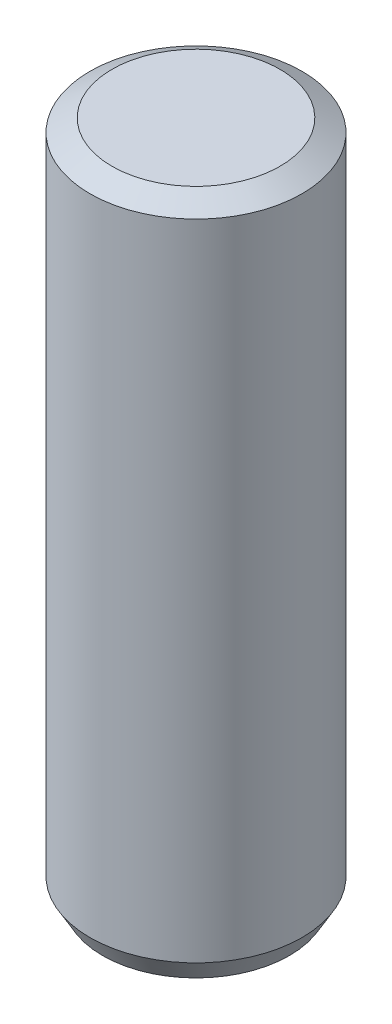
ISO-10303-21;
HEADER;
FILE_DESCRIPTION(('STEP AP214'),'2;1');
FILE_NAME('part.step','',(''),(''),'','','');
FILE_SCHEMA(('AUTOMOTIVE_DESIGN { 1 0 10303 214 1 1 1 1 }'));
ENDSEC;
DATA;
#1=APPLICATION_CONTEXT('core data for automotive mechanical design processes');
#2=APPLICATION_PROTOCOL_DEFINITION('international standard','automotive_design',2000,#1);
#3=PRODUCT_CONTEXT('',#1,'mechanical');
#4=PRODUCT('Part','Part','',(#3));
#5=PRODUCT_RELATED_PRODUCT_CATEGORY('part','',(#4));
#6=PRODUCT_DEFINITION_FORMATION('','',#4);
#7=PRODUCT_DEFINITION_CONTEXT('part definition',#1,'design');
#8=PRODUCT_DEFINITION('design','',#6,#7);
#9=PRODUCT_DEFINITION_SHAPE('','',#8);
#10=(LENGTH_UNIT() NAMED_UNIT(*) SI_UNIT(.MILLI.,.METRE.));
#11=(NAMED_UNIT(*) PLANE_ANGLE_UNIT() SI_UNIT($,.RADIAN.));
#12=(NAMED_UNIT(*) SI_UNIT($,.STERADIAN.) SOLID_ANGLE_UNIT());
#13=UNCERTAINTY_MEASURE_WITH_UNIT(LENGTH_MEASURE(1.E-05),#10,'distance_accuracy_value','');
#14=(GEOMETRIC_REPRESENTATION_CONTEXT(3) GLOBAL_UNCERTAINTY_ASSIGNED_CONTEXT((#13)) GLOBAL_UNIT_ASSIGNED_CONTEXT((#10,
#11,#12)) REPRESENTATION_CONTEXT('',''));
#15=CARTESIAN_POINT('',(0.,0.,0.));
#16=DIRECTION('',(0.,0.,1.));
#17=DIRECTION('',(1.,0.,0.));
#18=AXIS2_PLACEMENT_3D('',#15,#16,#17);
#19=CARTESIAN_POINT('',(0.,16.,0.));
#20=DIRECTION('',(0.,-1.,0.));
#21=DIRECTION('',(0.,0.,-1.));
#22=AXIS2_PLACEMENT_3D('',#19,#20,#21);
#23=CYLINDRICAL_SURFACE('',#22,2.5);
#24=CARTESIAN_POINT('',(0.,0.519615242270658,0.));
#25=DIRECTION('',(0.,1.,0.));
#26=DIRECTION('',(0.,0.,1.));
#27=AXIS2_PLACEMENT_3D('',#24,#25,#26);
#28=CIRCLE('',#27,2.5);
#29=CARTESIAN_POINT('',(0.,0.519615242270658,2.5));
#30=VERTEX_POINT('',#29);
#31=EDGE_CURVE('E53',#30,#30,#28,.T.);
#32=ORIENTED_EDGE('',*,*,#31,.T.);
#33=EDGE_LOOP('',(#32));
#34=FACE_BOUND('',#33,.T.);
#35=CARTESIAN_POINT('',(0.,15.7,0.));
#36=DIRECTION('',(0.,1.,0.));
#37=DIRECTION('',(0.,0.,1.));
#38=AXIS2_PLACEMENT_3D('',#35,#36,#37);
#39=CIRCLE('',#38,2.5);
#40=CARTESIAN_POINT('',(0.,15.7,2.5));
#41=VERTEX_POINT('',#40);
#42=EDGE_CURVE('E58',#41,#41,#39,.F.);
#43=ORIENTED_EDGE('',*,*,#42,.T.);
#44=EDGE_LOOP('',(#43));
#45=FACE_BOUND('',#44,.T.);
#46=ADVANCED_FACE('F39',(#34,#45),#23,.T.);
#47=CARTESIAN_POINT('',(0.,16.,0.));
#48=DIRECTION('',(0.,1.,0.));
#49=DIRECTION('',(0.,0.,1.));
#50=AXIS2_PLACEMENT_3D('',#47,#48,#49);
#51=PLANE('',#50);
#52=CARTESIAN_POINT('',(0.,16.,0.));
#53=DIRECTION('',(0.,1.,0.));
#54=DIRECTION('',(0.,0.,1.));
#55=AXIS2_PLACEMENT_3D('',#52,#53,#54);
#56=CIRCLE('',#55,1.98038475772933);
#57=CARTESIAN_POINT('',(0.,16.,1.98038475772933));
#58=VERTEX_POINT('',#57);
#59=EDGE_CURVE('E10',#58,#58,#56,.T.);
#60=ORIENTED_EDGE('',*,*,#59,.T.);
#61=EDGE_LOOP('',(#60));
#62=FACE_BOUND('',#61,.T.);
#63=ADVANCED_FACE('F75',(#62),#51,.T.);
#64=CARTESIAN_POINT('',(0.,0.,0.));
#65=DIRECTION('',(0.,1.,0.));
#66=DIRECTION('',(0.,0.,1.));
#67=AXIS2_PLACEMENT_3D('',#64,#65,#66);
#68=PLANE('',#67);
#69=CARTESIAN_POINT('',(0.,0.,0.));
#70=DIRECTION('',(0.,1.,0.));
#71=DIRECTION('',(0.,0.,1.));
#72=AXIS2_PLACEMENT_3D('',#69,#70,#71);
#73=CIRCLE('',#72,2.2);
#74=CARTESIAN_POINT('',(0.,0.,2.2));
#75=VERTEX_POINT('',#74);
#76=EDGE_CURVE('E48',#75,#75,#73,.F.);
#77=ORIENTED_EDGE('',*,*,#76,.T.);
#78=EDGE_LOOP('',(#77));
#79=FACE_BOUND('',#78,.T.);
#80=ADVANCED_FACE('F72',(#79),#68,.F.);
#81=CARTESIAN_POINT('',(0.,0.519615242270658,0.));
#82=DIRECTION('',(0.,1.,0.));
#83=DIRECTION('',(0.,0.,1.));
#84=AXIS2_PLACEMENT_3D('',#81,#82,#83);
#85=CONICAL_SURFACE('',#84,2.5,0.523598775598301);
#86=ORIENTED_EDGE('',*,*,#76,.F.);
#87=EDGE_LOOP('',(#86));
#88=FACE_BOUND('',#87,.T.);
#89=ORIENTED_EDGE('',*,*,#31,.F.);
#90=EDGE_LOOP('',(#89));
#91=FACE_BOUND('',#90,.T.);
#92=ADVANCED_FACE('F68',(#88,#91),#85,.T.);
#93=CARTESIAN_POINT('',(0.,16.,0.));
#94=DIRECTION('',(0.,-1.,0.));
#95=DIRECTION('',(0.,0.,-1.));
#96=AXIS2_PLACEMENT_3D('',#93,#94,#95);
#97=CONICAL_SURFACE('',#96,1.98038475772933,1.0471975511966);
#98=ORIENTED_EDGE('',*,*,#42,.F.);
#99=EDGE_LOOP('',(#98));
#100=FACE_BOUND('',#99,.T.);
#101=ORIENTED_EDGE('',*,*,#59,.F.);
#102=EDGE_LOOP('',(#101));
#103=FACE_BOUND('',#102,.T.);
#104=ADVANCED_FACE('F42',(#100,#103),#97,.T.);
#105=CLOSED_SHELL('',(#46,#63,#80,#92,#104));
#106=MANIFOLD_SOLID_BREP('B2',#105);
#107=ADVANCED_BREP_SHAPE_REPRESENTATION('',(#18,#106),#14);
#108=SHAPE_DEFINITION_REPRESENTATION(#9,#107);
ENDSEC;
END-ISO-10303-21;
